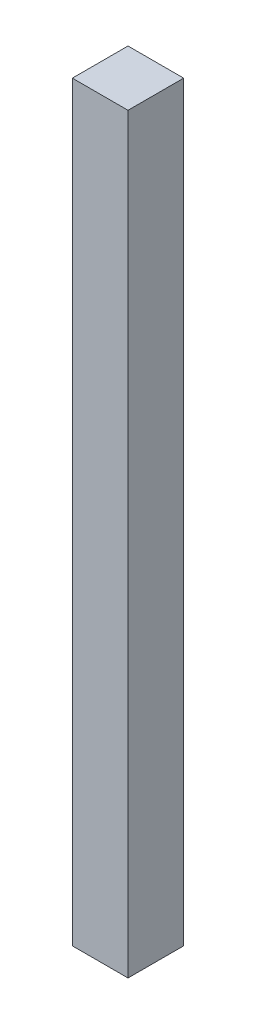
ISO-10303-21;
HEADER;
FILE_DESCRIPTION(('STEP AP214'),'2;1');
FILE_NAME('part.step','',(''),(''),'','','');
FILE_SCHEMA(('AUTOMOTIVE_DESIGN { 1 0 10303 214 1 1 1 1 }'));
ENDSEC;
DATA;
#1=APPLICATION_CONTEXT('core data for automotive mechanical design processes');
#2=APPLICATION_PROTOCOL_DEFINITION('international standard','automotive_design',2000,#1);
#3=PRODUCT_CONTEXT('',#1,'mechanical');
#4=PRODUCT('Part','Part','',(#3));
#5=PRODUCT_RELATED_PRODUCT_CATEGORY('part','',(#4));
#6=PRODUCT_DEFINITION_FORMATION('','',#4);
#7=PRODUCT_DEFINITION_CONTEXT('part definition',#1,'design');
#8=PRODUCT_DEFINITION('design','',#6,#7);
#9=PRODUCT_DEFINITION_SHAPE('','',#8);
#10=(LENGTH_UNIT() NAMED_UNIT(*) SI_UNIT(.MILLI.,.METRE.));
#11=(NAMED_UNIT(*) PLANE_ANGLE_UNIT() SI_UNIT($,.RADIAN.));
#12=(NAMED_UNIT(*) SI_UNIT($,.STERADIAN.) SOLID_ANGLE_UNIT());
#13=UNCERTAINTY_MEASURE_WITH_UNIT(LENGTH_MEASURE(1.E-05),#10,'distance_accuracy_value','');
#14=(GEOMETRIC_REPRESENTATION_CONTEXT(3) GLOBAL_UNCERTAINTY_ASSIGNED_CONTEXT((#13)) GLOBAL_UNIT_ASSIGNED_CONTEXT((#10,
#11,#12)) REPRESENTATION_CONTEXT('',''));
#15=CARTESIAN_POINT('',(0.,0.,0.));
#16=DIRECTION('',(0.,0.,1.));
#17=DIRECTION('',(1.,0.,0.));
#18=AXIS2_PLACEMENT_3D('',#15,#16,#17);
#19=CARTESIAN_POINT('',(0.,135.,0.));
#20=DIRECTION('',(1.,0.,0.));
#21=DIRECTION('',(0.,0.,-1.));
#22=AXIS2_PLACEMENT_3D('',#19,#20,#21);
#23=PLANE('',#22);
#24=DIRECTION('',(0.,0.,1.));
#25=VECTOR('',#24,1.);
#26=CARTESIAN_POINT('',(0.,0.,0.));
#27=LINE('',#26,#25);
#28=CARTESIAN_POINT('',(0.,0.,-10.));
#29=VERTEX_POINT('',#28);
#30=CARTESIAN_POINT('',(0.,0.,0.));
#31=VERTEX_POINT('',#30);
#32=EDGE_CURVE('E97',#29,#31,#27,.T.);
#33=ORIENTED_EDGE('',*,*,#32,.T.);
#34=DIRECTION('',(0.,-1.,0.));
#35=VECTOR('',#34,1.);
#36=CARTESIAN_POINT('',(0.,135.,0.));
#37=LINE('',#36,#35);
#38=CARTESIAN_POINT('',(0.,135.,0.));
#39=VERTEX_POINT('',#38);
#40=EDGE_CURVE('E11',#39,#31,#37,.T.);
#41=ORIENTED_EDGE('',*,*,#40,.F.);
#42=DIRECTION('',(0.,0.,1.));
#43=VECTOR('',#42,1.);
#44=CARTESIAN_POINT('',(0.,135.,0.));
#45=LINE('',#44,#43);
#46=CARTESIAN_POINT('',(0.,135.,-10.));
#47=VERTEX_POINT('',#46);
#48=EDGE_CURVE('E85',#47,#39,#45,.T.);
#49=ORIENTED_EDGE('',*,*,#48,.F.);
#50=DIRECTION('',(0.,-1.,0.));
#51=VECTOR('',#50,1.);
#52=CARTESIAN_POINT('',(0.,135.,-10.));
#53=LINE('',#52,#51);
#54=EDGE_CURVE('E93',#47,#29,#53,.T.);
#55=ORIENTED_EDGE('',*,*,#54,.T.);
#56=EDGE_LOOP('',(#33,#41,#49,#55));
#57=FACE_BOUND('',#56,.T.);
#58=ADVANCED_FACE('F34',(#57),#23,.F.);
#59=CARTESIAN_POINT('',(0.,135.,0.));
#60=DIRECTION('',(0.,0.,-1.));
#61=DIRECTION('',(-1.,0.,0.));
#62=AXIS2_PLACEMENT_3D('',#59,#60,#61);
#63=PLANE('',#62);
#64=DIRECTION('',(1.,0.,0.));
#65=VECTOR('',#64,1.);
#66=CARTESIAN_POINT('',(0.,0.,0.));
#67=LINE('',#66,#65);
#68=CARTESIAN_POINT('',(10.,0.,0.));
#69=VERTEX_POINT('',#68);
#70=EDGE_CURVE('E89',#31,#69,#67,.T.);
#71=ORIENTED_EDGE('',*,*,#70,.T.);
#72=DIRECTION('',(0.,-1.,0.));
#73=VECTOR('',#72,1.);
#74=CARTESIAN_POINT('',(10.,135.,0.));
#75=LINE('',#74,#73);
#76=CARTESIAN_POINT('',(10.,135.,0.));
#77=VERTEX_POINT('',#76);
#78=EDGE_CURVE('E42',#77,#69,#75,.T.);
#79=ORIENTED_EDGE('',*,*,#78,.F.);
#80=DIRECTION('',(1.,0.,0.));
#81=VECTOR('',#80,1.);
#82=CARTESIAN_POINT('',(0.,135.,0.));
#83=LINE('',#82,#81);
#84=EDGE_CURVE('E80',#39,#77,#83,.T.);
#85=ORIENTED_EDGE('',*,*,#84,.F.);
#86=ORIENTED_EDGE('',*,*,#40,.T.);
#87=EDGE_LOOP('',(#71,#79,#85,#86));
#88=FACE_BOUND('',#87,.T.);
#89=ADVANCED_FACE('F88',(#88),#63,.F.);
#90=CARTESIAN_POINT('',(10.,135.,0.));
#91=DIRECTION('',(-1.,0.,0.));
#92=DIRECTION('',(0.,0.,1.));
#93=AXIS2_PLACEMENT_3D('',#90,#91,#92);
#94=PLANE('',#93);
#95=DIRECTION('',(0.,0.,-1.));
#96=VECTOR('',#95,1.);
#97=CARTESIAN_POINT('',(10.,0.,0.));
#98=LINE('',#97,#96);
#99=CARTESIAN_POINT('',(10.,0.,-10.));
#100=VERTEX_POINT('',#99);
#101=EDGE_CURVE('E67',#69,#100,#98,.T.);
#102=ORIENTED_EDGE('',*,*,#101,.T.);
#103=DIRECTION('',(0.,-1.,0.));
#104=VECTOR('',#103,1.);
#105=CARTESIAN_POINT('',(10.,135.,-10.));
#106=LINE('',#105,#104);
#107=CARTESIAN_POINT('',(10.,135.,-10.));
#108=VERTEX_POINT('',#107);
#109=EDGE_CURVE('E90',#108,#100,#106,.T.);
#110=ORIENTED_EDGE('',*,*,#109,.F.);
#111=DIRECTION('',(0.,0.,-1.));
#112=VECTOR('',#111,1.);
#113=CARTESIAN_POINT('',(10.,135.,0.));
#114=LINE('',#113,#112);
#115=EDGE_CURVE('E83',#77,#108,#114,.T.);
#116=ORIENTED_EDGE('',*,*,#115,.F.);
#117=ORIENTED_EDGE('',*,*,#78,.T.);
#118=EDGE_LOOP('',(#102,#110,#116,#117));
#119=FACE_BOUND('',#118,.T.);
#120=ADVANCED_FACE('F91',(#119),#94,.F.);
#121=CARTESIAN_POINT('',(0.,135.,-10.));
#122=DIRECTION('',(0.,0.,1.));
#123=DIRECTION('',(1.,0.,0.));
#124=AXIS2_PLACEMENT_3D('',#121,#122,#123);
#125=PLANE('',#124);
#126=DIRECTION('',(-1.,0.,0.));
#127=VECTOR('',#126,1.);
#128=CARTESIAN_POINT('',(0.,0.,-10.));
#129=LINE('',#128,#127);
#130=EDGE_CURVE('E73',#100,#29,#129,.T.);
#131=ORIENTED_EDGE('',*,*,#130,.T.);
#132=ORIENTED_EDGE('',*,*,#54,.F.);
#133=DIRECTION('',(-1.,0.,0.));
#134=VECTOR('',#133,1.);
#135=CARTESIAN_POINT('',(0.,135.,-10.));
#136=LINE('',#135,#134);
#137=EDGE_CURVE('E50',#108,#47,#136,.T.);
#138=ORIENTED_EDGE('',*,*,#137,.F.);
#139=ORIENTED_EDGE('',*,*,#109,.T.);
#140=EDGE_LOOP('',(#131,#132,#138,#139));
#141=FACE_BOUND('',#140,.T.);
#142=ADVANCED_FACE('F104',(#141),#125,.F.);
#143=CARTESIAN_POINT('',(0.,135.,0.));
#144=DIRECTION('',(0.,-1.,0.));
#145=DIRECTION('',(0.,0.,-1.));
#146=AXIS2_PLACEMENT_3D('',#143,#144,#145);
#147=PLANE('',#146);
#148=ORIENTED_EDGE('',*,*,#48,.T.);
#149=ORIENTED_EDGE('',*,*,#84,.T.);
#150=ORIENTED_EDGE('',*,*,#115,.T.);
#151=ORIENTED_EDGE('',*,*,#137,.T.);
#152=EDGE_LOOP('',(#148,#149,#150,#151));
#153=FACE_BOUND('',#152,.T.);
#154=ADVANCED_FACE('F81',(#153),#147,.F.);
#155=CARTESIAN_POINT('',(0.,0.,0.));
#156=DIRECTION('',(0.,-1.,0.));
#157=DIRECTION('',(0.,0.,-1.));
#158=AXIS2_PLACEMENT_3D('',#155,#156,#157);
#159=PLANE('',#158);
#160=ORIENTED_EDGE('',*,*,#32,.F.);
#161=ORIENTED_EDGE('',*,*,#130,.F.);
#162=ORIENTED_EDGE('',*,*,#101,.F.);
#163=ORIENTED_EDGE('',*,*,#70,.F.);
#164=EDGE_LOOP('',(#160,#161,#162,#163));
#165=FACE_BOUND('',#164,.T.);
#166=ADVANCED_FACE('F107',(#165),#159,.T.);
#167=CLOSED_SHELL('',(#58,#89,#120,#142,#154,#166));
#168=MANIFOLD_SOLID_BREP('B2',#167);
#169=ADVANCED_BREP_SHAPE_REPRESENTATION('',(#18,#168),#14);
#170=SHAPE_DEFINITION_REPRESENTATION(#9,#169);
ENDSEC;
END-ISO-10303-21;
